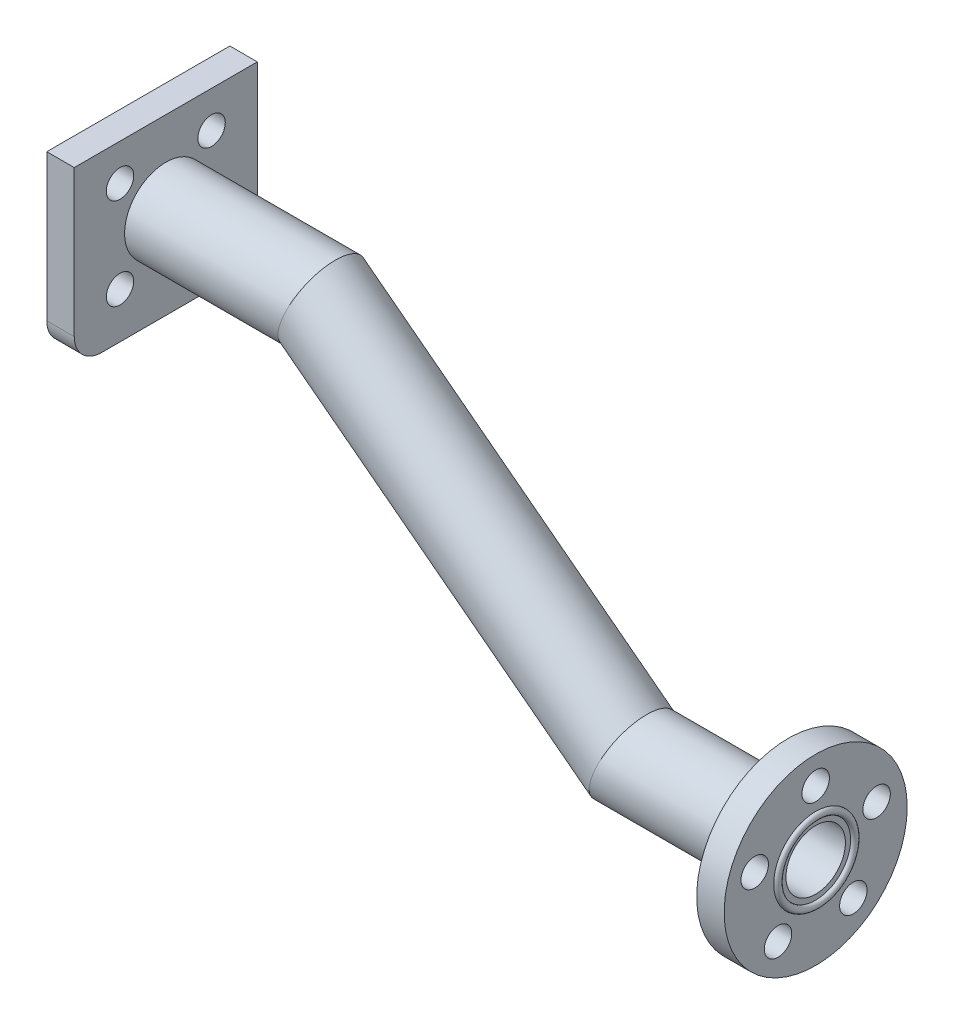
ISO-10303-21;
HEADER;
FILE_DESCRIPTION(('STEP AP214'),'2;1');
FILE_NAME('part.step','',(''),(''),'','','');
FILE_SCHEMA(('AUTOMOTIVE_DESIGN { 1 0 10303 214 1 1 1 1 }'));
ENDSEC;
DATA;
#1=APPLICATION_CONTEXT('core data for automotive mechanical design processes');
#2=APPLICATION_PROTOCOL_DEFINITION('international standard','automotive_design',2000,#1);
#3=PRODUCT_CONTEXT('',#1,'mechanical');
#4=PRODUCT('Part','Part','',(#3));
#5=PRODUCT_RELATED_PRODUCT_CATEGORY('part','',(#4));
#6=PRODUCT_DEFINITION_FORMATION('','',#4);
#7=PRODUCT_DEFINITION_CONTEXT('part definition',#1,'design');
#8=PRODUCT_DEFINITION('design','',#6,#7);
#9=PRODUCT_DEFINITION_SHAPE('','',#8);
#10=(LENGTH_UNIT() NAMED_UNIT(*) SI_UNIT(.MILLI.,.METRE.));
#11=(NAMED_UNIT(*) PLANE_ANGLE_UNIT() SI_UNIT($,.RADIAN.));
#12=(NAMED_UNIT(*) SI_UNIT($,.STERADIAN.) SOLID_ANGLE_UNIT());
#13=UNCERTAINTY_MEASURE_WITH_UNIT(LENGTH_MEASURE(1.E-05),#10,'distance_accuracy_value','');
#14=(GEOMETRIC_REPRESENTATION_CONTEXT(3) GLOBAL_UNCERTAINTY_ASSIGNED_CONTEXT((#13)) GLOBAL_UNIT_ASSIGNED_CONTEXT((#10,
#11,#12)) REPRESENTATION_CONTEXT('',''));
#15=CARTESIAN_POINT('',(0.,0.,0.));
#16=DIRECTION('',(0.,0.,1.));
#17=DIRECTION('',(1.,0.,0.));
#18=AXIS2_PLACEMENT_3D('',#15,#16,#17);
#19=CARTESIAN_POINT('',(74.,-25.5,0.));
#20=DIRECTION('',(1.,0.,0.));
#21=DIRECTION('',(0.,0.,-1.));
#22=AXIS2_PLACEMENT_3D('',#19,#20,#21);
#23=PLANE('',#22);
#24=CARTESIAN_POINT('',(74.,-25.5,0.));
#25=DIRECTION('',(1.,0.,0.));
#26=DIRECTION('',(0.,0.,-1.));
#27=AXIS2_PLACEMENT_3D('',#24,#25,#26);
#28=CIRCLE('',#27,10.);
#29=CARTESIAN_POINT('',(74.,-25.5,-10.));
#30=VERTEX_POINT('',#29);
#31=EDGE_CURVE('E213',#30,#30,#28,.T.);
#32=ORIENTED_EDGE('',*,*,#31,.T.);
#33=EDGE_LOOP('',(#32));
#34=FACE_BOUND('',#33,.T.);
#35=CARTESIAN_POINT('',(74.,-23.3368810393751,-6.65739561406629));
#36=DIRECTION('',(1.,0.,0.));
#37=DIRECTION('',(0.,0.,-1.));
#38=AXIS2_PLACEMENT_3D('',#35,#36,#37);
#39=CIRCLE('',#38,1.5);
#40=CARTESIAN_POINT('',(74.,-23.3368810393751,-8.15739561406629));
#41=VERTEX_POINT('',#40);
#42=EDGE_CURVE('E194',#41,#41,#39,.T.);
#43=ORIENTED_EDGE('',*,*,#42,.F.);
#44=EDGE_LOOP('',(#43));
#45=FACE_BOUND('',#44,.T.);
#46=CARTESIAN_POINT('',(74.,-31.1631189606245,-4.11449676604782));
#47=DIRECTION('',(1.,0.,0.));
#48=DIRECTION('',(0.,0.,-1.));
#49=AXIS2_PLACEMENT_3D('',#46,#47,#48);
#50=CIRCLE('',#49,1.49999999999944);
#51=CARTESIAN_POINT('',(74.,-31.1631189606245,-5.61449676604725));
#52=VERTEX_POINT('',#51);
#53=EDGE_CURVE('E202',#52,#52,#50,.T.);
#54=ORIENTED_EDGE('',*,*,#53,.F.);
#55=EDGE_LOOP('',(#54));
#56=FACE_BOUND('',#55,.T.);
#57=CARTESIAN_POINT('',(74.,-31.1631189606248,4.11449676604683));
#58=DIRECTION('',(1.,0.,0.));
#59=DIRECTION('',(0.,0.,-1.));
#60=AXIS2_PLACEMENT_3D('',#57,#58,#59);
#61=CIRCLE('',#60,1.49999999999954);
#62=CARTESIAN_POINT('',(74.,-31.1631189606248,2.61449676604729));
#63=VERTEX_POINT('',#62);
#64=EDGE_CURVE('E181',#63,#63,#61,.T.);
#65=ORIENTED_EDGE('',*,*,#64,.F.);
#66=EDGE_LOOP('',(#65));
#67=FACE_BOUND('',#66,.T.);
#68=CARTESIAN_POINT('',(74.,-23.3368810393756,6.65739561406584));
#69=DIRECTION('',(1.,0.,0.));
#70=DIRECTION('',(0.,0.,-1.));
#71=AXIS2_PLACEMENT_3D('',#68,#69,#70);
#72=CIRCLE('',#71,1.5);
#73=CARTESIAN_POINT('',(74.,-23.3368810393756,5.15739561406584));
#74=VERTEX_POINT('',#73);
#75=EDGE_CURVE('E170',#74,#74,#72,.T.);
#76=ORIENTED_EDGE('',*,*,#75,.F.);
#77=EDGE_LOOP('',(#76));
#78=FACE_BOUND('',#77,.T.);
#79=CARTESIAN_POINT('',(74.,-18.5,0.));
#80=DIRECTION('',(1.,0.,0.));
#81=DIRECTION('',(0.,0.,-1.));
#82=AXIS2_PLACEMENT_3D('',#79,#80,#81);
#83=CIRCLE('',#82,1.5);
#84=CARTESIAN_POINT('',(74.,-18.5,-1.5));
#85=VERTEX_POINT('',#84);
#86=EDGE_CURVE('E189',#85,#85,#83,.T.);
#87=ORIENTED_EDGE('',*,*,#86,.F.);
#88=EDGE_LOOP('',(#87));
#89=FACE_BOUND('',#88,.T.);
#90=CARTESIAN_POINT('',(74.,-25.5,0.));
#91=DIRECTION('',(1.,0.,0.));
#92=DIRECTION('',(0.,0.,-1.));
#93=AXIS2_PLACEMENT_3D('',#90,#91,#92);
#94=CIRCLE('',#93,4.58000000000001);
#95=CARTESIAN_POINT('',(74.,-25.5,-4.58000000000001));
#96=VERTEX_POINT('',#95);
#97=EDGE_CURVE('E48',#96,#96,#94,.F.);
#98=ORIENTED_EDGE('',*,*,#97,.T.);
#99=EDGE_LOOP('',(#98));
#100=FACE_BOUND('',#99,.T.);
#101=ADVANCED_FACE('F44',(#34,#45,#56,#67,#78,#89,#100),#23,.T.);
#102=CARTESIAN_POINT('',(74.,-25.5,0.));
#103=DIRECTION('',(1.,0.,0.));
#104=DIRECTION('',(0.,0.,-1.));
#105=AXIS2_PLACEMENT_3D('',#102,#103,#104);
#106=CIRCLE('',#105,3.25);
#107=CARTESIAN_POINT('',(74.,-25.5,-3.25));
#108=VERTEX_POINT('',#107);
#109=EDGE_CURVE('E185',#108,#108,#106,.T.);
#110=ORIENTED_EDGE('',*,*,#109,.F.);
#111=EDGE_LOOP('',(#110));
#112=FACE_BOUND('',#111,.T.);
#113=CARTESIAN_POINT('',(74.,-25.5,0.));
#114=DIRECTION('',(-1.,0.,0.));
#115=DIRECTION('',(0.,0.,1.));
#116=AXIS2_PLACEMENT_3D('',#113,#114,#115);
#117=CIRCLE('',#116,3.81999999999999);
#118=CARTESIAN_POINT('',(74.,-25.5,3.81999999999999));
#119=VERTEX_POINT('',#118);
#120=EDGE_CURVE('E163',#119,#119,#117,.F.);
#121=ORIENTED_EDGE('',*,*,#120,.T.);
#122=EDGE_LOOP('',(#121));
#123=FACE_BOUND('',#122,.T.);
#124=ADVANCED_FACE('F295',(#112,#123),#23,.T.);
#125=CARTESIAN_POINT('',(3.,-6.5,-7.));
#126=DIRECTION('',(-1.,0.,0.));
#127=DIRECTION('',(0.,0.,1.));
#128=AXIS2_PLACEMENT_3D('',#125,#126,#127);
#129=PLANE('',#128);
#130=CARTESIAN_POINT('',(3.,0.500000000000003,0.));
#131=DIRECTION('',(1.,0.,0.));
#132=DIRECTION('',(0.,0.,-1.));
#133=AXIS2_PLACEMENT_3D('',#130,#131,#132);
#134=CIRCLE('',#133,4.5);
#135=CARTESIAN_POINT('',(3.,0.500000000000003,-4.5));
#136=VERTEX_POINT('',#135);
#137=EDGE_CURVE('E231',#136,#136,#134,.T.);
#138=ORIENTED_EDGE('',*,*,#137,.F.);
#139=EDGE_LOOP('',(#138));
#140=FACE_BOUND('',#139,.T.);
#141=DIRECTION('',(0.,1.,0.));
#142=VECTOR('',#141,1.);
#143=CARTESIAN_POINT('',(3.,9.5,-10.));
#144=LINE('',#143,#142);
#145=CARTESIAN_POINT('',(3.,-6.49999999999998,-10.));
#146=VERTEX_POINT('',#145);
#147=CARTESIAN_POINT('',(3.,9.5,-10.));
#148=VERTEX_POINT('',#147);
#149=EDGE_CURVE('E154',#146,#148,#144,.T.);
#150=ORIENTED_EDGE('',*,*,#149,.T.);
#151=DIRECTION('',(0.,0.,1.));
#152=VECTOR('',#151,1.);
#153=CARTESIAN_POINT('',(3.,9.5,-10.));
#154=LINE('',#153,#152);
#155=CARTESIAN_POINT('',(3.,9.5,10.));
#156=VERTEX_POINT('',#155);
#157=EDGE_CURVE('E101',#148,#156,#154,.T.);
#158=ORIENTED_EDGE('',*,*,#157,.T.);
#159=DIRECTION('',(0.,-1.,0.));
#160=VECTOR('',#159,1.);
#161=CARTESIAN_POINT('',(3.,9.5,10.));
#162=LINE('',#161,#160);
#163=CARTESIAN_POINT('',(3.,-6.49999999999998,10.));
#164=VERTEX_POINT('',#163);
#165=EDGE_CURVE('E115',#156,#164,#162,.T.);
#166=ORIENTED_EDGE('',*,*,#165,.T.);
#167=CARTESIAN_POINT('',(3.,-6.5,7.));
#168=DIRECTION('',(1.,0.,0.));
#169=DIRECTION('',(0.,0.,1.));
#170=AXIS2_PLACEMENT_3D('',#167,#168,#169);
#171=CIRCLE('',#170,3.);
#172=CARTESIAN_POINT('',(3.,-9.5,6.99999999999998));
#173=VERTEX_POINT('',#172);
#174=EDGE_CURVE('E108',#164,#173,#171,.T.);
#175=ORIENTED_EDGE('',*,*,#174,.T.);
#176=DIRECTION('',(0.,0.,-1.));
#177=VECTOR('',#176,1.);
#178=CARTESIAN_POINT('',(3.,-9.5,-6.99999999999998));
#179=LINE('',#178,#177);
#180=CARTESIAN_POINT('',(3.,-9.5,-6.99999999999998));
#181=VERTEX_POINT('',#180);
#182=EDGE_CURVE('E113',#173,#181,#179,.T.);
#183=ORIENTED_EDGE('',*,*,#182,.T.);
#184=CARTESIAN_POINT('',(3.,-6.5,-7.));
#185=DIRECTION('',(1.,0.,0.));
#186=DIRECTION('',(0.,0.,1.));
#187=AXIS2_PLACEMENT_3D('',#184,#185,#186);
#188=CIRCLE('',#187,3.);
#189=EDGE_CURVE('E64',#181,#146,#188,.T.);
#190=ORIENTED_EDGE('',*,*,#189,.T.);
#191=EDGE_LOOP('',(#150,#158,#166,#175,#183,#190));
#192=FACE_BOUND('',#191,.T.);
#193=CARTESIAN_POINT('',(3.,5.5,-5.));
#194=DIRECTION('',(1.,0.,0.));
#195=DIRECTION('',(0.,0.,-1.));
#196=AXIS2_PLACEMENT_3D('',#193,#194,#195);
#197=CIRCLE('',#196,1.5);
#198=CARTESIAN_POINT('',(3.,5.5,-6.5));
#199=VERTEX_POINT('',#198);
#200=EDGE_CURVE('E271',#199,#199,#197,.T.);
#201=ORIENTED_EDGE('',*,*,#200,.F.);
#202=EDGE_LOOP('',(#201));
#203=FACE_BOUND('',#202,.T.);
#204=CARTESIAN_POINT('',(3.,5.5,5.));
#205=DIRECTION('',(1.,0.,0.));
#206=DIRECTION('',(0.,0.,1.));
#207=AXIS2_PLACEMENT_3D('',#204,#205,#206);
#208=CIRCLE('',#207,1.5);
#209=CARTESIAN_POINT('',(3.,5.5,6.5));
#210=VERTEX_POINT('',#209);
#211=EDGE_CURVE('E263',#210,#210,#208,.T.);
#212=ORIENTED_EDGE('',*,*,#211,.F.);
#213=EDGE_LOOP('',(#212));
#214=FACE_BOUND('',#213,.T.);
#215=CARTESIAN_POINT('',(3.,-4.5,5.));
#216=DIRECTION('',(1.,0.,0.));
#217=DIRECTION('',(0.,0.,-1.));
#218=AXIS2_PLACEMENT_3D('',#215,#216,#217);
#219=CIRCLE('',#218,1.5);
#220=CARTESIAN_POINT('',(3.,-4.5,3.5));
#221=VERTEX_POINT('',#220);
#222=EDGE_CURVE('E255',#221,#221,#219,.T.);
#223=ORIENTED_EDGE('',*,*,#222,.F.);
#224=EDGE_LOOP('',(#223));
#225=FACE_BOUND('',#224,.T.);
#226=CARTESIAN_POINT('',(3.,-4.5,-5.));
#227=DIRECTION('',(1.,0.,0.));
#228=DIRECTION('',(0.,0.,1.));
#229=AXIS2_PLACEMENT_3D('',#226,#227,#228);
#230=CIRCLE('',#229,1.5);
#231=CARTESIAN_POINT('',(3.,-4.5,-3.5));
#232=VERTEX_POINT('',#231);
#233=EDGE_CURVE('E247',#232,#232,#230,.T.);
#234=ORIENTED_EDGE('',*,*,#233,.F.);
#235=EDGE_LOOP('',(#234));
#236=FACE_BOUND('',#235,.T.);
#237=ADVANCED_FACE('F110',(#140,#192,#203,#214,#225,#236),#129,.F.);
#238=CARTESIAN_POINT('',(0.,-6.5,-7.));
#239=DIRECTION('',(-1.,0.,0.));
#240=DIRECTION('',(0.,0.,1.));
#241=AXIS2_PLACEMENT_3D('',#238,#239,#240);
#242=PLANE('',#241);
#243=CARTESIAN_POINT('',(0.,-4.5,5.));
#244=DIRECTION('',(1.,0.,0.));
#245=DIRECTION('',(0.,0.,-1.));
#246=AXIS2_PLACEMENT_3D('',#243,#244,#245);
#247=CIRCLE('',#246,1.5);
#248=CARTESIAN_POINT('',(0.,-4.5,3.5));
#249=VERTEX_POINT('',#248);
#250=EDGE_CURVE('E251',#249,#249,#247,.T.);
#251=ORIENTED_EDGE('',*,*,#250,.T.);
#252=EDGE_LOOP('',(#251));
#253=FACE_BOUND('',#252,.T.);
#254=CARTESIAN_POINT('',(0.,5.5,-5.));
#255=DIRECTION('',(1.,0.,0.));
#256=DIRECTION('',(0.,0.,-1.));
#257=AXIS2_PLACEMENT_3D('',#254,#255,#256);
#258=CIRCLE('',#257,1.5);
#259=CARTESIAN_POINT('',(0.,5.5,-6.5));
#260=VERTEX_POINT('',#259);
#261=EDGE_CURVE('E267',#260,#260,#258,.T.);
#262=ORIENTED_EDGE('',*,*,#261,.T.);
#263=EDGE_LOOP('',(#262));
#264=FACE_BOUND('',#263,.T.);
#265=DIRECTION('',(0.,1.,0.));
#266=VECTOR('',#265,1.);
#267=CARTESIAN_POINT('',(0.,9.5,-10.));
#268=LINE('',#267,#266);
#269=CARTESIAN_POINT('',(0.,-6.49999999999998,-10.));
#270=VERTEX_POINT('',#269);
#271=CARTESIAN_POINT('',(0.,9.5,-10.));
#272=VERTEX_POINT('',#271);
#273=EDGE_CURVE('E137',#270,#272,#268,.T.);
#274=ORIENTED_EDGE('',*,*,#273,.F.);
#275=CARTESIAN_POINT('',(0.,-6.5,-7.));
#276=DIRECTION('',(1.,0.,0.));
#277=DIRECTION('',(0.,0.,1.));
#278=AXIS2_PLACEMENT_3D('',#275,#276,#277);
#279=CIRCLE('',#278,3.);
#280=CARTESIAN_POINT('',(0.,-9.5,-6.99999999999998));
#281=VERTEX_POINT('',#280);
#282=EDGE_CURVE('E93',#281,#270,#279,.T.);
#283=ORIENTED_EDGE('',*,*,#282,.F.);
#284=DIRECTION('',(0.,0.,-1.));
#285=VECTOR('',#284,1.);
#286=CARTESIAN_POINT('',(0.,-9.5,-6.99999999999998));
#287=LINE('',#286,#285);
#288=CARTESIAN_POINT('',(0.,-9.5,6.99999999999998));
#289=VERTEX_POINT('',#288);
#290=EDGE_CURVE('E87',#289,#281,#287,.T.);
#291=ORIENTED_EDGE('',*,*,#290,.F.);
#292=CARTESIAN_POINT('',(0.,-6.5,7.));
#293=DIRECTION('',(1.,0.,0.));
#294=DIRECTION('',(0.,0.,1.));
#295=AXIS2_PLACEMENT_3D('',#292,#293,#294);
#296=CIRCLE('',#295,3.);
#297=CARTESIAN_POINT('',(0.,-6.49999999999998,10.));
#298=VERTEX_POINT('',#297);
#299=EDGE_CURVE('E124',#298,#289,#296,.T.);
#300=ORIENTED_EDGE('',*,*,#299,.F.);
#301=DIRECTION('',(0.,-1.,0.));
#302=VECTOR('',#301,1.);
#303=CARTESIAN_POINT('',(0.,9.5,10.));
#304=LINE('',#303,#302);
#305=CARTESIAN_POINT('',(0.,9.5,10.));
#306=VERTEX_POINT('',#305);
#307=EDGE_CURVE('E145',#306,#298,#304,.T.);
#308=ORIENTED_EDGE('',*,*,#307,.F.);
#309=DIRECTION('',(0.,0.,1.));
#310=VECTOR('',#309,1.);
#311=CARTESIAN_POINT('',(0.,9.5,-10.));
#312=LINE('',#311,#310);
#313=EDGE_CURVE('E141',#272,#306,#312,.T.);
#314=ORIENTED_EDGE('',*,*,#313,.F.);
#315=EDGE_LOOP('',(#274,#283,#291,#300,#308,#314));
#316=FACE_BOUND('',#315,.T.);
#317=CARTESIAN_POINT('',(0.,0.500000000000003,0.));
#318=DIRECTION('',(1.,0.,0.));
#319=DIRECTION('',(0.,0.,-1.));
#320=AXIS2_PLACEMENT_3D('',#317,#318,#319);
#321=CIRCLE('',#320,3.25);
#322=CARTESIAN_POINT('',(0.,0.500000000000003,-3.25));
#323=VERTEX_POINT('',#322);
#324=EDGE_CURVE('E142',#323,#323,#321,.T.);
#325=ORIENTED_EDGE('',*,*,#324,.T.);
#326=EDGE_LOOP('',(#325));
#327=FACE_BOUND('',#326,.T.);
#328=CARTESIAN_POINT('',(0.,5.5,5.));
#329=DIRECTION('',(1.,0.,0.));
#330=DIRECTION('',(0.,0.,1.));
#331=AXIS2_PLACEMENT_3D('',#328,#329,#330);
#332=CIRCLE('',#331,1.5);
#333=CARTESIAN_POINT('',(0.,5.5,6.5));
#334=VERTEX_POINT('',#333);
#335=EDGE_CURVE('E259',#334,#334,#332,.T.);
#336=ORIENTED_EDGE('',*,*,#335,.T.);
#337=EDGE_LOOP('',(#336));
#338=FACE_BOUND('',#337,.T.);
#339=CARTESIAN_POINT('',(0.,-4.5,-5.));
#340=DIRECTION('',(1.,0.,0.));
#341=DIRECTION('',(0.,0.,1.));
#342=AXIS2_PLACEMENT_3D('',#339,#340,#341);
#343=CIRCLE('',#342,1.5);
#344=CARTESIAN_POINT('',(0.,-4.5,-3.5));
#345=VERTEX_POINT('',#344);
#346=EDGE_CURVE('E240',#345,#345,#343,.T.);
#347=ORIENTED_EDGE('',*,*,#346,.T.);
#348=EDGE_LOOP('',(#347));
#349=FACE_BOUND('',#348,.T.);
#350=ADVANCED_FACE('F359',(#253,#264,#316,#327,#338,#349),#242,.T.);
#351=CARTESIAN_POINT('',(3.,9.5,-10.));
#352=DIRECTION('',(0.,0.,1.));
#353=DIRECTION('',(1.,0.,0.));
#354=AXIS2_PLACEMENT_3D('',#351,#352,#353);
#355=PLANE('',#354);
#356=ORIENTED_EDGE('',*,*,#273,.T.);
#357=DIRECTION('',(-1.,0.,0.));
#358=VECTOR('',#357,1.);
#359=CARTESIAN_POINT('',(3.,9.5,-10.));
#360=LINE('',#359,#358);
#361=EDGE_CURVE('E12',#148,#272,#360,.T.);
#362=ORIENTED_EDGE('',*,*,#361,.F.);
#363=ORIENTED_EDGE('',*,*,#149,.F.);
#364=DIRECTION('',(-1.,0.,0.));
#365=VECTOR('',#364,1.);
#366=CARTESIAN_POINT('',(3.,-6.49999999999998,-10.));
#367=LINE('',#366,#365);
#368=EDGE_CURVE('E133',#146,#270,#367,.T.);
#369=ORIENTED_EDGE('',*,*,#368,.T.);
#370=EDGE_LOOP('',(#356,#362,#363,#369));
#371=FACE_BOUND('',#370,.T.);
#372=ADVANCED_FACE('F46',(#371),#355,.F.);
#373=CARTESIAN_POINT('',(3.,9.5,-10.));
#374=DIRECTION('',(0.,-1.,0.));
#375=DIRECTION('',(0.,0.,-1.));
#376=AXIS2_PLACEMENT_3D('',#373,#374,#375);
#377=PLANE('',#376);
#378=ORIENTED_EDGE('',*,*,#313,.T.);
#379=DIRECTION('',(-1.,0.,0.));
#380=VECTOR('',#379,1.);
#381=CARTESIAN_POINT('',(3.,9.5,10.));
#382=LINE('',#381,#380);
#383=EDGE_CURVE('E55',#156,#306,#382,.T.);
#384=ORIENTED_EDGE('',*,*,#383,.F.);
#385=ORIENTED_EDGE('',*,*,#157,.F.);
#386=ORIENTED_EDGE('',*,*,#361,.T.);
#387=EDGE_LOOP('',(#378,#384,#385,#386));
#388=FACE_BOUND('',#387,.T.);
#389=ADVANCED_FACE('F372',(#388),#377,.F.);
#390=CARTESIAN_POINT('',(3.,9.5,10.));
#391=DIRECTION('',(0.,0.,-1.));
#392=DIRECTION('',(0.,1.,0.));
#393=AXIS2_PLACEMENT_3D('',#390,#391,#392);
#394=PLANE('',#393);
#395=ORIENTED_EDGE('',*,*,#307,.T.);
#396=DIRECTION('',(-1.,0.,0.));
#397=VECTOR('',#396,1.);
#398=CARTESIAN_POINT('',(3.,-6.49999999999998,10.));
#399=LINE('',#398,#397);
#400=EDGE_CURVE('E126',#164,#298,#399,.T.);
#401=ORIENTED_EDGE('',*,*,#400,.F.);
#402=ORIENTED_EDGE('',*,*,#165,.F.);
#403=ORIENTED_EDGE('',*,*,#383,.T.);
#404=EDGE_LOOP('',(#395,#401,#402,#403));
#405=FACE_BOUND('',#404,.T.);
#406=ADVANCED_FACE('F370',(#405),#394,.F.);
#407=CARTESIAN_POINT('',(3.,-6.5,7.));
#408=DIRECTION('',(-1.,0.,0.));
#409=DIRECTION('',(0.,0.,1.));
#410=AXIS2_PLACEMENT_3D('',#407,#408,#409);
#411=CYLINDRICAL_SURFACE('',#410,3.);
#412=ORIENTED_EDGE('',*,*,#299,.T.);
#413=DIRECTION('',(-1.,0.,0.));
#414=VECTOR('',#413,1.);
#415=CARTESIAN_POINT('',(3.,-9.5,6.99999999999998));
#416=LINE('',#415,#414);
#417=EDGE_CURVE('E121',#173,#289,#416,.T.);
#418=ORIENTED_EDGE('',*,*,#417,.F.);
#419=ORIENTED_EDGE('',*,*,#174,.F.);
#420=ORIENTED_EDGE('',*,*,#400,.T.);
#421=EDGE_LOOP('',(#412,#418,#419,#420));
#422=FACE_BOUND('',#421,.T.);
#423=ADVANCED_FACE('F122',(#422),#411,.T.);
#424=CARTESIAN_POINT('',(3.,-9.5,-6.99999999999998));
#425=DIRECTION('',(0.,1.,0.));
#426=DIRECTION('',(0.,0.,1.));
#427=AXIS2_PLACEMENT_3D('',#424,#425,#426);
#428=PLANE('',#427);
#429=ORIENTED_EDGE('',*,*,#290,.T.);
#430=DIRECTION('',(-1.,0.,0.));
#431=VECTOR('',#430,1.);
#432=CARTESIAN_POINT('',(3.,-9.5,-6.99999999999998));
#433=LINE('',#432,#431);
#434=EDGE_CURVE('E127',#181,#281,#433,.T.);
#435=ORIENTED_EDGE('',*,*,#434,.F.);
#436=ORIENTED_EDGE('',*,*,#182,.F.);
#437=ORIENTED_EDGE('',*,*,#417,.T.);
#438=EDGE_LOOP('',(#429,#435,#436,#437));
#439=FACE_BOUND('',#438,.T.);
#440=ADVANCED_FACE('F129',(#439),#428,.F.);
#441=CARTESIAN_POINT('',(3.,-6.5,-7.));
#442=DIRECTION('',(-1.,0.,0.));
#443=DIRECTION('',(0.,0.,1.));
#444=AXIS2_PLACEMENT_3D('',#441,#442,#443);
#445=CYLINDRICAL_SURFACE('',#444,3.);
#446=ORIENTED_EDGE('',*,*,#282,.T.);
#447=ORIENTED_EDGE('',*,*,#368,.F.);
#448=ORIENTED_EDGE('',*,*,#189,.F.);
#449=ORIENTED_EDGE('',*,*,#434,.T.);
#450=EDGE_LOOP('',(#446,#447,#448,#449));
#451=FACE_BOUND('',#450,.T.);
#452=ADVANCED_FACE('F355',(#451),#445,.T.);
#453=CARTESIAN_POINT('',(3.,0.500000000000003,0.));
#454=DIRECTION('',(-1.,0.,0.));
#455=DIRECTION('',(0.,0.,1.));
#456=AXIS2_PLACEMENT_3D('',#453,#454,#455);
#457=CYLINDRICAL_SURFACE('',#456,3.25);
#458=ORIENTED_EDGE('',*,*,#324,.F.);
#459=EDGE_LOOP('',(#458));
#460=FACE_BOUND('',#459,.T.);
#461=CARTESIAN_POINT('',(20.,0.500000000000003,0.));
#462=DIRECTION('',(0.947195289519853,-0.320657267984685,0.));
#463=DIRECTION('',(0.320657267984685,0.947195289519853,0.));
#464=AXIS2_PLACEMENT_3D('',#461,#462,#463);
#465=ELLIPSE('',#464,3.43118260400922,3.25);
#466=CARTESIAN_POINT('',(21.1002336397582,3.75,0.));
#467=VERTEX_POINT('',#466);
#468=EDGE_CURVE('E226',#467,#467,#465,.F.);
#469=ORIENTED_EDGE('',*,*,#468,.F.);
#470=EDGE_LOOP('',(#469));
#471=FACE_BOUND('',#470,.T.);
#472=ADVANCED_FACE('F351',(#460,#471),#457,.F.);
#473=CARTESIAN_POINT('',(3.,5.5,-5.));
#474=DIRECTION('',(-1.,0.,0.));
#475=DIRECTION('',(0.,0.,1.));
#476=AXIS2_PLACEMENT_3D('',#473,#474,#475);
#477=CYLINDRICAL_SURFACE('',#476,1.5);
#478=ORIENTED_EDGE('',*,*,#200,.T.);
#479=EDGE_LOOP('',(#478));
#480=FACE_BOUND('',#479,.T.);
#481=ORIENTED_EDGE('',*,*,#261,.F.);
#482=EDGE_LOOP('',(#481));
#483=FACE_BOUND('',#482,.T.);
#484=ADVANCED_FACE('F347',(#480,#483),#477,.F.);
#485=CARTESIAN_POINT('',(3.,5.5,5.));
#486=DIRECTION('',(-1.,0.,0.));
#487=DIRECTION('',(0.,0.,1.));
#488=AXIS2_PLACEMENT_3D('',#485,#486,#487);
#489=CYLINDRICAL_SURFACE('',#488,1.5);
#490=ORIENTED_EDGE('',*,*,#211,.T.);
#491=EDGE_LOOP('',(#490));
#492=FACE_BOUND('',#491,.T.);
#493=ORIENTED_EDGE('',*,*,#335,.F.);
#494=EDGE_LOOP('',(#493));
#495=FACE_BOUND('',#494,.T.);
#496=ADVANCED_FACE('F343',(#492,#495),#489,.F.);
#497=CARTESIAN_POINT('',(3.,-4.5,5.));
#498=DIRECTION('',(-1.,0.,0.));
#499=DIRECTION('',(0.,0.,1.));
#500=AXIS2_PLACEMENT_3D('',#497,#498,#499);
#501=CYLINDRICAL_SURFACE('',#500,1.5);
#502=ORIENTED_EDGE('',*,*,#222,.T.);
#503=EDGE_LOOP('',(#502));
#504=FACE_BOUND('',#503,.T.);
#505=ORIENTED_EDGE('',*,*,#250,.F.);
#506=EDGE_LOOP('',(#505));
#507=FACE_BOUND('',#506,.T.);
#508=ADVANCED_FACE('F339',(#504,#507),#501,.F.);
#509=CARTESIAN_POINT('',(3.,-4.5,-5.));
#510=DIRECTION('',(-1.,0.,0.));
#511=DIRECTION('',(0.,0.,1.));
#512=AXIS2_PLACEMENT_3D('',#509,#510,#511);
#513=CYLINDRICAL_SURFACE('',#512,1.5);
#514=ORIENTED_EDGE('',*,*,#233,.T.);
#515=EDGE_LOOP('',(#514));
#516=FACE_BOUND('',#515,.T.);
#517=ORIENTED_EDGE('',*,*,#346,.F.);
#518=EDGE_LOOP('',(#517));
#519=FACE_BOUND('',#518,.T.);
#520=ADVANCED_FACE('F330',(#516,#519),#513,.F.);
#521=CARTESIAN_POINT('',(50.5485190665828,-25.5,0.));
#522=DIRECTION('',(1.,0.,0.));
#523=DIRECTION('',(0.,0.,-1.));
#524=AXIS2_PLACEMENT_3D('',#521,#522,#523);
#525=CYLINDRICAL_SURFACE('',#524,4.5);
#526=CARTESIAN_POINT('',(54.,-25.5,0.));
#527=DIRECTION('',(0.947195289519853,-0.320657267984685,0.));
#528=DIRECTION('',(-0.320657267984685,-0.947195289519853,0.));
#529=AXIS2_PLACEMENT_3D('',#526,#527,#528);
#530=ELLIPSE('',#529,4.75086822093585,4.5);
#531=CARTESIAN_POINT('',(52.4765995757194,-30.,0.));
#532=VERTEX_POINT('',#531);
#533=EDGE_CURVE('E236',#532,#532,#530,.F.);
#534=ORIENTED_EDGE('',*,*,#533,.F.);
#535=EDGE_LOOP('',(#534));
#536=FACE_BOUND('',#535,.T.);
#537=CARTESIAN_POINT('',(71.,-25.5,0.));
#538=DIRECTION('',(1.,0.,0.));
#539=DIRECTION('',(0.,0.,-1.));
#540=AXIS2_PLACEMENT_3D('',#537,#538,#539);
#541=CIRCLE('',#540,4.5);
#542=CARTESIAN_POINT('',(71.,-25.5,-4.5));
#543=VERTEX_POINT('',#542);
#544=EDGE_CURVE('E230',#543,#543,#541,.T.);
#545=ORIENTED_EDGE('',*,*,#544,.F.);
#546=EDGE_LOOP('',(#545));
#547=FACE_BOUND('',#546,.T.);
#548=ADVANCED_FACE('F325',(#536,#547),#525,.T.);
#549=CARTESIAN_POINT('',(17.2582890851686,2.59660246428284,0.));
#550=DIRECTION('',(0.794357832977196,-0.607450107570797,0.));
#551=DIRECTION('',(0.607450107570797,0.794357832977196,0.));
#552=AXIS2_PLACEMENT_3D('',#549,#550,#551);
#553=CYLINDRICAL_SURFACE('',#552,4.5);
#554=CARTESIAN_POINT('',(20.,0.500000000000003,0.));
#555=DIRECTION('',(0.947195289519853,-0.320657267984685,0.));
#556=DIRECTION('',(0.320657267984685,0.947195289519853,0.));
#557=AXIS2_PLACEMENT_3D('',#554,#555,#556);
#558=ELLIPSE('',#557,4.75086822093585,4.5);
#559=CARTESIAN_POINT('',(21.5234004242805,5.,0.));
#560=VERTEX_POINT('',#559);
#561=EDGE_CURVE('E235',#560,#560,#558,.F.);
#562=ORIENTED_EDGE('',*,*,#561,.F.);
#563=EDGE_LOOP('',(#562));
#564=FACE_BOUND('',#563,.T.);
#565=ORIENTED_EDGE('',*,*,#533,.T.);
#566=EDGE_LOOP('',(#565));
#567=FACE_BOUND('',#566,.T.);
#568=ADVANCED_FACE('F328',(#564,#567),#553,.T.);
#569=CARTESIAN_POINT('',(3.,0.500000000000003,0.));
#570=DIRECTION('',(1.,0.,0.));
#571=DIRECTION('',(0.,0.,-1.));
#572=AXIS2_PLACEMENT_3D('',#569,#570,#571);
#573=CYLINDRICAL_SURFACE('',#572,4.5);
#574=ORIENTED_EDGE('',*,*,#137,.T.);
#575=EDGE_LOOP('',(#574));
#576=FACE_BOUND('',#575,.T.);
#577=ORIENTED_EDGE('',*,*,#561,.T.);
#578=EDGE_LOOP('',(#577));
#579=FACE_BOUND('',#578,.T.);
#580=ADVANCED_FACE('F323',(#576,#579),#573,.T.);
#581=CARTESIAN_POINT('',(51.479485992532,-25.5,0.));
#582=DIRECTION('',(1.,0.,0.));
#583=DIRECTION('',(0.,0.,-1.));
#584=AXIS2_PLACEMENT_3D('',#581,#582,#583);
#585=CYLINDRICAL_SURFACE('',#584,3.25);
#586=CARTESIAN_POINT('',(54.,-25.5,0.));
#587=DIRECTION('',(0.947195289519853,-0.320657267984685,0.));
#588=DIRECTION('',(-0.320657267984685,-0.947195289519853,0.));
#589=AXIS2_PLACEMENT_3D('',#586,#587,#588);
#590=ELLIPSE('',#589,3.43118260400923,3.25);
#591=CARTESIAN_POINT('',(52.8997663602418,-28.75,0.));
#592=VERTEX_POINT('',#591);
#593=EDGE_CURVE('E217',#592,#592,#590,.F.);
#594=ORIENTED_EDGE('',*,*,#593,.T.);
#595=EDGE_LOOP('',(#594));
#596=FACE_BOUND('',#595,.T.);
#597=ORIENTED_EDGE('',*,*,#109,.T.);
#598=EDGE_LOOP('',(#597));
#599=FACE_BOUND('',#598,.T.);
#600=ADVANCED_FACE('F319',(#596,#599),#585,.F.);
#601=CARTESIAN_POINT('',(17.9978099550391,2.03108650497013,0.));
#602=DIRECTION('',(0.794357832977196,-0.607450107570797,0.));
#603=DIRECTION('',(0.607450107570797,0.794357832977196,0.));
#604=AXIS2_PLACEMENT_3D('',#601,#602,#603);
#605=CYLINDRICAL_SURFACE('',#604,3.25);
#606=ORIENTED_EDGE('',*,*,#468,.T.);
#607=EDGE_LOOP('',(#606));
#608=FACE_BOUND('',#607,.T.);
#609=ORIENTED_EDGE('',*,*,#593,.F.);
#610=EDGE_LOOP('',(#609));
#611=FACE_BOUND('',#610,.T.);
#612=ADVANCED_FACE('F311',(#608,#611),#605,.F.);
#613=CARTESIAN_POINT('',(71.,-25.5,0.));
#614=DIRECTION('',(1.,0.,0.));
#615=DIRECTION('',(0.,0.,-1.));
#616=AXIS2_PLACEMENT_3D('',#613,#614,#615);
#617=PLANE('',#616);
#618=CARTESIAN_POINT('',(71.,-18.5,0.));
#619=DIRECTION('',(1.,0.,0.));
#620=DIRECTION('',(0.,0.,-1.));
#621=AXIS2_PLACEMENT_3D('',#618,#619,#620);
#622=CIRCLE('',#621,1.5);
#623=CARTESIAN_POINT('',(71.,-18.5,-1.5));
#624=VERTEX_POINT('',#623);
#625=EDGE_CURVE('E222',#624,#624,#622,.T.);
#626=ORIENTED_EDGE('',*,*,#625,.T.);
#627=EDGE_LOOP('',(#626));
#628=FACE_BOUND('',#627,.T.);
#629=CARTESIAN_POINT('',(71.,-23.3368810393756,6.65739561406584));
#630=DIRECTION('',(1.,0.,0.));
#631=DIRECTION('',(0.,0.,-1.));
#632=AXIS2_PLACEMENT_3D('',#629,#630,#631);
#633=CIRCLE('',#632,1.5);
#634=CARTESIAN_POINT('',(71.,-23.3368810393756,5.15739561406584));
#635=VERTEX_POINT('',#634);
#636=EDGE_CURVE('E175',#635,#635,#633,.T.);
#637=ORIENTED_EDGE('',*,*,#636,.T.);
#638=EDGE_LOOP('',(#637));
#639=FACE_BOUND('',#638,.T.);
#640=CARTESIAN_POINT('',(71.,-31.1631189606248,4.11449676604683));
#641=DIRECTION('',(1.,0.,0.));
#642=DIRECTION('',(0.,0.,-1.));
#643=AXIS2_PLACEMENT_3D('',#640,#641,#642);
#644=CIRCLE('',#643,1.49999999999954);
#645=CARTESIAN_POINT('',(71.,-31.1631189606248,2.61449676604729));
#646=VERTEX_POINT('',#645);
#647=EDGE_CURVE('E206',#646,#646,#644,.T.);
#648=ORIENTED_EDGE('',*,*,#647,.T.);
#649=EDGE_LOOP('',(#648));
#650=FACE_BOUND('',#649,.T.);
#651=CARTESIAN_POINT('',(71.,-31.1631189606245,-4.11449676604782));
#652=DIRECTION('',(1.,0.,0.));
#653=DIRECTION('',(0.,0.,-1.));
#654=AXIS2_PLACEMENT_3D('',#651,#652,#653);
#655=CIRCLE('',#654,1.49999999999944);
#656=CARTESIAN_POINT('',(71.,-31.1631189606245,-5.61449676604725));
#657=VERTEX_POINT('',#656);
#658=EDGE_CURVE('E198',#657,#657,#655,.T.);
#659=ORIENTED_EDGE('',*,*,#658,.T.);
#660=EDGE_LOOP('',(#659));
#661=FACE_BOUND('',#660,.T.);
#662=CARTESIAN_POINT('',(71.,-23.3368810393751,-6.65739561406629));
#663=DIRECTION('',(1.,0.,0.));
#664=DIRECTION('',(0.,0.,-1.));
#665=AXIS2_PLACEMENT_3D('',#662,#663,#664);
#666=CIRCLE('',#665,1.5);
#667=CARTESIAN_POINT('',(71.,-23.3368810393751,-8.15739561406629));
#668=VERTEX_POINT('',#667);
#669=EDGE_CURVE('E190',#668,#668,#666,.T.);
#670=ORIENTED_EDGE('',*,*,#669,.T.);
#671=EDGE_LOOP('',(#670));
#672=FACE_BOUND('',#671,.T.);
#673=ORIENTED_EDGE('',*,*,#544,.T.);
#674=EDGE_LOOP('',(#673));
#675=FACE_BOUND('',#674,.T.);
#676=CARTESIAN_POINT('',(71.,-25.5,0.));
#677=DIRECTION('',(1.,0.,0.));
#678=DIRECTION('',(0.,0.,-1.));
#679=AXIS2_PLACEMENT_3D('',#676,#677,#678);
#680=CIRCLE('',#679,10.);
#681=CARTESIAN_POINT('',(71.,-25.5,-10.));
#682=VERTEX_POINT('',#681);
#683=EDGE_CURVE('E218',#682,#682,#680,.T.);
#684=ORIENTED_EDGE('',*,*,#683,.F.);
#685=EDGE_LOOP('',(#684));
#686=FACE_BOUND('',#685,.T.);
#687=ADVANCED_FACE('F307',(#628,#639,#650,#661,#672,#675,#686),#617,.F.);
#688=CARTESIAN_POINT('',(74.,-25.5,0.));
#689=DIRECTION('',(-1.,0.,0.));
#690=DIRECTION('',(0.,0.,1.));
#691=AXIS2_PLACEMENT_3D('',#688,#689,#690);
#692=CYLINDRICAL_SURFACE('',#691,10.);
#693=ORIENTED_EDGE('',*,*,#31,.F.);
#694=EDGE_LOOP('',(#693));
#695=FACE_BOUND('',#694,.T.);
#696=ORIENTED_EDGE('',*,*,#683,.T.);
#697=EDGE_LOOP('',(#696));
#698=FACE_BOUND('',#697,.T.);
#699=ADVANCED_FACE('F310',(#695,#698),#692,.T.);
#700=CARTESIAN_POINT('',(71.,-23.3368810393751,-6.65739561406629));
#701=DIRECTION('',(1.,0.,0.));
#702=DIRECTION('',(0.,0.,-1.));
#703=AXIS2_PLACEMENT_3D('',#700,#701,#702);
#704=CYLINDRICAL_SURFACE('',#703,1.5);
#705=ORIENTED_EDGE('',*,*,#669,.F.);
#706=EDGE_LOOP('',(#705));
#707=FACE_BOUND('',#706,.T.);
#708=ORIENTED_EDGE('',*,*,#42,.T.);
#709=EDGE_LOOP('',(#708));
#710=FACE_BOUND('',#709,.T.);
#711=ADVANCED_FACE('F315',(#707,#710),#704,.F.);
#712=CARTESIAN_POINT('',(71.,-31.1631189606245,-4.11449676604782));
#713=DIRECTION('',(1.,0.,0.));
#714=DIRECTION('',(0.,0.,-1.));
#715=AXIS2_PLACEMENT_3D('',#712,#713,#714);
#716=CYLINDRICAL_SURFACE('',#715,1.49999999999944);
#717=ORIENTED_EDGE('',*,*,#658,.F.);
#718=EDGE_LOOP('',(#717));
#719=FACE_BOUND('',#718,.T.);
#720=ORIENTED_EDGE('',*,*,#53,.T.);
#721=EDGE_LOOP('',(#720));
#722=FACE_BOUND('',#721,.T.);
#723=ADVANCED_FACE('F449',(#719,#722),#716,.F.);
#724=CARTESIAN_POINT('',(71.,-31.1631189606248,4.11449676604683));
#725=DIRECTION('',(1.,0.,0.));
#726=DIRECTION('',(0.,0.,-1.));
#727=AXIS2_PLACEMENT_3D('',#724,#725,#726);
#728=CYLINDRICAL_SURFACE('',#727,1.49999999999954);
#729=ORIENTED_EDGE('',*,*,#647,.F.);
#730=EDGE_LOOP('',(#729));
#731=FACE_BOUND('',#730,.T.);
#732=ORIENTED_EDGE('',*,*,#64,.T.);
#733=EDGE_LOOP('',(#732));
#734=FACE_BOUND('',#733,.T.);
#735=ADVANCED_FACE('F305',(#731,#734),#728,.F.);
#736=CARTESIAN_POINT('',(71.,-23.3368810393756,6.65739561406584));
#737=DIRECTION('',(1.,0.,0.));
#738=DIRECTION('',(0.,0.,-1.));
#739=AXIS2_PLACEMENT_3D('',#736,#737,#738);
#740=CYLINDRICAL_SURFACE('',#739,1.5);
#741=ORIENTED_EDGE('',*,*,#636,.F.);
#742=EDGE_LOOP('',(#741));
#743=FACE_BOUND('',#742,.T.);
#744=ORIENTED_EDGE('',*,*,#75,.T.);
#745=EDGE_LOOP('',(#744));
#746=FACE_BOUND('',#745,.T.);
#747=ADVANCED_FACE('F435',(#743,#746),#740,.F.);
#748=CARTESIAN_POINT('',(71.,-18.5,0.));
#749=DIRECTION('',(1.,0.,0.));
#750=DIRECTION('',(0.,0.,-1.));
#751=AXIS2_PLACEMENT_3D('',#748,#749,#750);
#752=CYLINDRICAL_SURFACE('',#751,1.5);
#753=ORIENTED_EDGE('',*,*,#625,.F.);
#754=EDGE_LOOP('',(#753));
#755=FACE_BOUND('',#754,.T.);
#756=ORIENTED_EDGE('',*,*,#86,.T.);
#757=EDGE_LOOP('',(#756));
#758=FACE_BOUND('',#757,.T.);
#759=ADVANCED_FACE('F292',(#755,#758),#752,.F.);
#760=CARTESIAN_POINT('',(74.,-25.5,0.));
#761=DIRECTION('',(-1.,0.,0.));
#762=DIRECTION('',(0.,0.,1.));
#763=AXIS2_PLACEMENT_3D('',#760,#761,#762);
#764=TOROIDAL_SURFACE('',#763,4.2,0.380000000000011);
#765=ORIENTED_EDGE('',*,*,#97,.F.);
#766=EDGE_LOOP('',(#765));
#767=FACE_BOUND('',#766,.T.);
#768=ORIENTED_EDGE('',*,*,#120,.F.);
#769=EDGE_LOOP('',(#768));
#770=FACE_BOUND('',#769,.T.);
#771=ADVANCED_FACE('F423',(#767,#770),#764,.T.);
#772=CLOSED_SHELL('',(#101,#124,#237,#350,#372,#389,#406,#423,#440,#452,#472,#484,#496,#508,
#520,#548,#568,#580,#600,#612,#687,#699,#711,#723,#735,#747,#759,#771));
#773=MANIFOLD_SOLID_BREP('B2',#772);
#774=ADVANCED_BREP_SHAPE_REPRESENTATION('',(#18,#773),#14);
#775=SHAPE_DEFINITION_REPRESENTATION(#9,#774);
ENDSEC;
END-ISO-10303-21;
